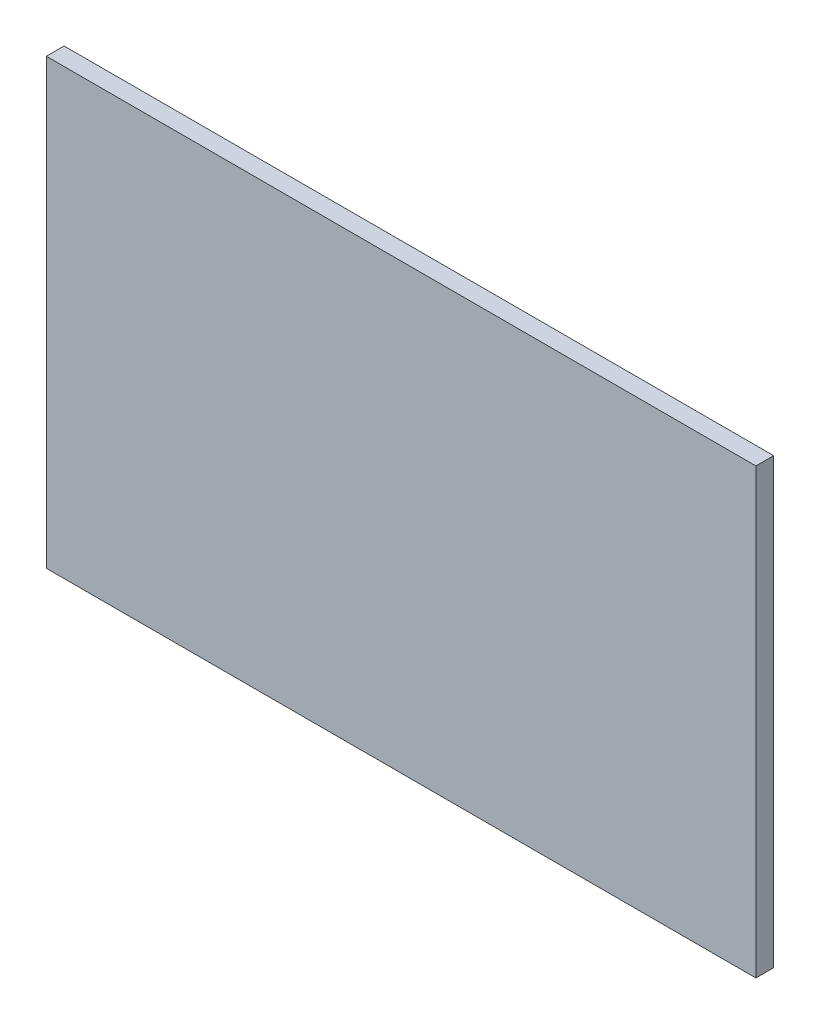
ISO-10303-21;
HEADER;
FILE_DESCRIPTION(('STEP AP214'),'2;1');
FILE_NAME('part.step','',(''),(''),'','','');
FILE_SCHEMA(('AUTOMOTIVE_DESIGN { 1 0 10303 214 1 1 1 1 }'));
ENDSEC;
DATA;
#1=APPLICATION_CONTEXT('core data for automotive mechanical design processes');
#2=APPLICATION_PROTOCOL_DEFINITION('international standard','automotive_design',2000,#1);
#3=PRODUCT_CONTEXT('',#1,'mechanical');
#4=PRODUCT('Part','Part','',(#3));
#5=PRODUCT_RELATED_PRODUCT_CATEGORY('part','',(#4));
#6=PRODUCT_DEFINITION_FORMATION('','',#4);
#7=PRODUCT_DEFINITION_CONTEXT('part definition',#1,'design');
#8=PRODUCT_DEFINITION('design','',#6,#7);
#9=PRODUCT_DEFINITION_SHAPE('','',#8);
#10=(LENGTH_UNIT() NAMED_UNIT(*) SI_UNIT(.MILLI.,.METRE.));
#11=(NAMED_UNIT(*) PLANE_ANGLE_UNIT() SI_UNIT($,.RADIAN.));
#12=(NAMED_UNIT(*) SI_UNIT($,.STERADIAN.) SOLID_ANGLE_UNIT());
#13=UNCERTAINTY_MEASURE_WITH_UNIT(LENGTH_MEASURE(1.E-05),#10,'distance_accuracy_value','');
#14=(GEOMETRIC_REPRESENTATION_CONTEXT(3) GLOBAL_UNCERTAINTY_ASSIGNED_CONTEXT((#13)) GLOBAL_UNIT_ASSIGNED_CONTEXT((#10,
#11,#12)) REPRESENTATION_CONTEXT('',''));
#15=CARTESIAN_POINT('',(0.,0.,0.));
#16=DIRECTION('',(0.,0.,1.));
#17=DIRECTION('',(1.,0.,0.));
#18=AXIS2_PLACEMENT_3D('',#15,#16,#17);
#19=CARTESIAN_POINT('',(0.,0.,10.));
#20=DIRECTION('',(1.,0.,0.));
#21=DIRECTION('',(0.,0.,-1.));
#22=AXIS2_PLACEMENT_3D('',#19,#20,#21);
#23=PLANE('',#22);
#24=DIRECTION('',(0.,-1.,0.));
#25=VECTOR('',#24,1.);
#26=CARTESIAN_POINT('',(0.,0.,0.));
#27=LINE('',#26,#25);
#28=CARTESIAN_POINT('',(0.,250.,0.));
#29=VERTEX_POINT('',#28);
#30=CARTESIAN_POINT('',(0.,0.,0.));
#31=VERTEX_POINT('',#30);
#32=EDGE_CURVE('E95',#29,#31,#27,.T.);
#33=ORIENTED_EDGE('',*,*,#32,.T.);
#34=DIRECTION('',(0.,0.,-1.));
#35=VECTOR('',#34,1.);
#36=CARTESIAN_POINT('',(0.,0.,10.));
#37=LINE('',#36,#35);
#38=CARTESIAN_POINT('',(0.,0.,10.));
#39=VERTEX_POINT('',#38);
#40=EDGE_CURVE('E11',#39,#31,#37,.T.);
#41=ORIENTED_EDGE('',*,*,#40,.F.);
#42=DIRECTION('',(0.,-1.,0.));
#43=VECTOR('',#42,1.);
#44=CARTESIAN_POINT('',(0.,0.,10.));
#45=LINE('',#44,#43);
#46=CARTESIAN_POINT('',(0.,250.,10.));
#47=VERTEX_POINT('',#46);
#48=EDGE_CURVE('E83',#47,#39,#45,.T.);
#49=ORIENTED_EDGE('',*,*,#48,.F.);
#50=DIRECTION('',(0.,0.,-1.));
#51=VECTOR('',#50,1.);
#52=CARTESIAN_POINT('',(0.,250.,10.));
#53=LINE('',#52,#51);
#54=EDGE_CURVE('E91',#47,#29,#53,.T.);
#55=ORIENTED_EDGE('',*,*,#54,.T.);
#56=EDGE_LOOP('',(#33,#41,#49,#55));
#57=FACE_BOUND('',#56,.T.);
#58=ADVANCED_FACE('F32',(#57),#23,.F.);
#59=CARTESIAN_POINT('',(0.,0.,10.));
#60=DIRECTION('',(0.,1.,0.));
#61=DIRECTION('',(0.,0.,1.));
#62=AXIS2_PLACEMENT_3D('',#59,#60,#61);
#63=PLANE('',#62);
#64=DIRECTION('',(1.,0.,0.));
#65=VECTOR('',#64,1.);
#66=CARTESIAN_POINT('',(0.,0.,0.));
#67=LINE('',#66,#65);
#68=CARTESIAN_POINT('',(399.999999999999,0.,0.));
#69=VERTEX_POINT('',#68);
#70=EDGE_CURVE('E87',#31,#69,#67,.T.);
#71=ORIENTED_EDGE('',*,*,#70,.T.);
#72=DIRECTION('',(0.,0.,-1.));
#73=VECTOR('',#72,1.);
#74=CARTESIAN_POINT('',(399.999999999999,0.,10.));
#75=LINE('',#74,#73);
#76=CARTESIAN_POINT('',(399.999999999999,0.,10.));
#77=VERTEX_POINT('',#76);
#78=EDGE_CURVE('E40',#77,#69,#75,.T.);
#79=ORIENTED_EDGE('',*,*,#78,.F.);
#80=DIRECTION('',(1.,0.,0.));
#81=VECTOR('',#80,1.);
#82=CARTESIAN_POINT('',(0.,0.,10.));
#83=LINE('',#82,#81);
#84=EDGE_CURVE('E78',#39,#77,#83,.T.);
#85=ORIENTED_EDGE('',*,*,#84,.F.);
#86=ORIENTED_EDGE('',*,*,#40,.T.);
#87=EDGE_LOOP('',(#71,#79,#85,#86));
#88=FACE_BOUND('',#87,.T.);
#89=ADVANCED_FACE('F86',(#88),#63,.F.);
#90=CARTESIAN_POINT('',(399.999999999999,0.,10.));
#91=DIRECTION('',(-1.,0.,0.));
#92=DIRECTION('',(0.,0.,1.));
#93=AXIS2_PLACEMENT_3D('',#90,#91,#92);
#94=PLANE('',#93);
#95=DIRECTION('',(0.,1.,0.));
#96=VECTOR('',#95,1.);
#97=CARTESIAN_POINT('',(399.999999999999,0.,0.));
#98=LINE('',#97,#96);
#99=CARTESIAN_POINT('',(399.999999999999,250.,0.));
#100=VERTEX_POINT('',#99);
#101=EDGE_CURVE('E65',#69,#100,#98,.T.);
#102=ORIENTED_EDGE('',*,*,#101,.T.);
#103=DIRECTION('',(0.,0.,-1.));
#104=VECTOR('',#103,1.);
#105=CARTESIAN_POINT('',(399.999999999999,250.,10.));
#106=LINE('',#105,#104);
#107=CARTESIAN_POINT('',(399.999999999999,250.,10.));
#108=VERTEX_POINT('',#107);
#109=EDGE_CURVE('E88',#108,#100,#106,.T.);
#110=ORIENTED_EDGE('',*,*,#109,.F.);
#111=DIRECTION('',(0.,1.,0.));
#112=VECTOR('',#111,1.);
#113=CARTESIAN_POINT('',(399.999999999999,0.,10.));
#114=LINE('',#113,#112);
#115=EDGE_CURVE('E81',#77,#108,#114,.T.);
#116=ORIENTED_EDGE('',*,*,#115,.F.);
#117=ORIENTED_EDGE('',*,*,#78,.T.);
#118=EDGE_LOOP('',(#102,#110,#116,#117));
#119=FACE_BOUND('',#118,.T.);
#120=ADVANCED_FACE('F89',(#119),#94,.F.);
#121=CARTESIAN_POINT('',(0.,250.,10.));
#122=DIRECTION('',(0.,-1.,0.));
#123=DIRECTION('',(0.,0.,-1.));
#124=AXIS2_PLACEMENT_3D('',#121,#122,#123);
#125=PLANE('',#124);
#126=DIRECTION('',(-1.,0.,0.));
#127=VECTOR('',#126,1.);
#128=CARTESIAN_POINT('',(0.,250.,0.));
#129=LINE('',#128,#127);
#130=EDGE_CURVE('E71',#100,#29,#129,.T.);
#131=ORIENTED_EDGE('',*,*,#130,.T.);
#132=ORIENTED_EDGE('',*,*,#54,.F.);
#133=DIRECTION('',(-1.,0.,0.));
#134=VECTOR('',#133,1.);
#135=CARTESIAN_POINT('',(0.,250.,10.));
#136=LINE('',#135,#134);
#137=EDGE_CURVE('E48',#108,#47,#136,.T.);
#138=ORIENTED_EDGE('',*,*,#137,.F.);
#139=ORIENTED_EDGE('',*,*,#109,.T.);
#140=EDGE_LOOP('',(#131,#132,#138,#139));
#141=FACE_BOUND('',#140,.T.);
#142=ADVANCED_FACE('F102',(#141),#125,.F.);
#143=CARTESIAN_POINT('',(0.,0.,10.));
#144=DIRECTION('',(0.,0.,-1.));
#145=DIRECTION('',(-1.,0.,0.));
#146=AXIS2_PLACEMENT_3D('',#143,#144,#145);
#147=PLANE('',#146);
#148=ORIENTED_EDGE('',*,*,#48,.T.);
#149=ORIENTED_EDGE('',*,*,#84,.T.);
#150=ORIENTED_EDGE('',*,*,#115,.T.);
#151=ORIENTED_EDGE('',*,*,#137,.T.);
#152=EDGE_LOOP('',(#148,#149,#150,#151));
#153=FACE_BOUND('',#152,.T.);
#154=ADVANCED_FACE('F79',(#153),#147,.F.);
#155=CARTESIAN_POINT('',(0.,0.,0.));
#156=DIRECTION('',(0.,0.,-1.));
#157=DIRECTION('',(-1.,0.,0.));
#158=AXIS2_PLACEMENT_3D('',#155,#156,#157);
#159=PLANE('',#158);
#160=ORIENTED_EDGE('',*,*,#32,.F.);
#161=ORIENTED_EDGE('',*,*,#130,.F.);
#162=ORIENTED_EDGE('',*,*,#101,.F.);
#163=ORIENTED_EDGE('',*,*,#70,.F.);
#164=EDGE_LOOP('',(#160,#161,#162,#163));
#165=FACE_BOUND('',#164,.T.);
#166=ADVANCED_FACE('F105',(#165),#159,.T.);
#167=CLOSED_SHELL('',(#58,#89,#120,#142,#154,#166));
#168=MANIFOLD_SOLID_BREP('B2',#167);
#169=ADVANCED_BREP_SHAPE_REPRESENTATION('',(#18,#168),#14);
#170=SHAPE_DEFINITION_REPRESENTATION(#9,#169);
ENDSEC;
END-ISO-10303-21;
